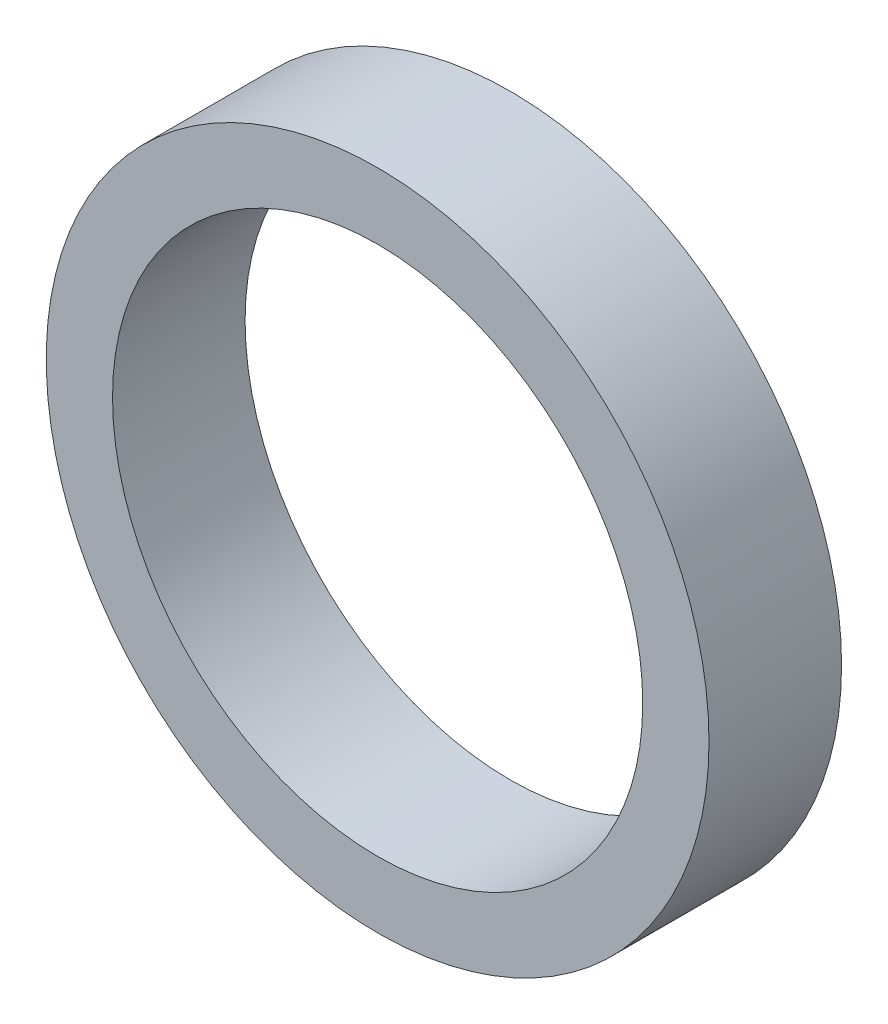
ISO-10303-21;
HEADER;
FILE_DESCRIPTION(('STEP AP214'),'2;1');
FILE_NAME('part.step','',(''),(''),'','','');
FILE_SCHEMA(('AUTOMOTIVE_DESIGN { 1 0 10303 214 1 1 1 1 }'));
ENDSEC;
DATA;
#1=APPLICATION_CONTEXT('core data for automotive mechanical design processes');
#2=APPLICATION_PROTOCOL_DEFINITION('international standard','automotive_design',2000,#1);
#3=PRODUCT_CONTEXT('',#1,'mechanical');
#4=PRODUCT('Part','Part','',(#3));
#5=PRODUCT_RELATED_PRODUCT_CATEGORY('part','',(#4));
#6=PRODUCT_DEFINITION_FORMATION('','',#4);
#7=PRODUCT_DEFINITION_CONTEXT('part definition',#1,'design');
#8=PRODUCT_DEFINITION('design','',#6,#7);
#9=PRODUCT_DEFINITION_SHAPE('','',#8);
#10=(LENGTH_UNIT() NAMED_UNIT(*) SI_UNIT(.MILLI.,.METRE.));
#11=(NAMED_UNIT(*) PLANE_ANGLE_UNIT() SI_UNIT($,.RADIAN.));
#12=(NAMED_UNIT(*) SI_UNIT($,.STERADIAN.) SOLID_ANGLE_UNIT());
#13=UNCERTAINTY_MEASURE_WITH_UNIT(LENGTH_MEASURE(1.E-05),#10,'distance_accuracy_value','');
#14=(GEOMETRIC_REPRESENTATION_CONTEXT(3) GLOBAL_UNCERTAINTY_ASSIGNED_CONTEXT((#13)) GLOBAL_UNIT_ASSIGNED_CONTEXT((#10,
#11,#12)) REPRESENTATION_CONTEXT('',''));
#15=CARTESIAN_POINT('',(0.,0.,0.));
#16=DIRECTION('',(0.,0.,1.));
#17=DIRECTION('',(1.,0.,0.));
#18=AXIS2_PLACEMENT_3D('',#15,#16,#17);
#19=CARTESIAN_POINT('',(0.,0.,2.));
#20=DIRECTION('',(0.,0.,1.));
#21=DIRECTION('',(1.,0.,0.));
#22=AXIS2_PLACEMENT_3D('',#19,#20,#21);
#23=PLANE('',#22);
#24=CARTESIAN_POINT('',(0.,0.,2.));
#25=DIRECTION('',(0.,0.,1.));
#26=DIRECTION('',(1.,0.,0.));
#27=AXIS2_PLACEMENT_3D('',#24,#25,#26);
#28=CIRCLE('',#27,5.);
#29=CARTESIAN_POINT('',(5.,0.,2.));
#30=VERTEX_POINT('',#29);
#31=EDGE_CURVE('E10',#30,#30,#28,.T.);
#32=ORIENTED_EDGE('',*,*,#31,.T.);
#33=EDGE_LOOP('',(#32));
#34=FACE_BOUND('',#33,.T.);
#35=CARTESIAN_POINT('',(0.,0.,2.));
#36=DIRECTION('',(0.,0.,1.));
#37=DIRECTION('',(1.,0.,0.));
#38=AXIS2_PLACEMENT_3D('',#35,#36,#37);
#39=CIRCLE('',#38,4.);
#40=CARTESIAN_POINT('',(4.,0.,2.));
#41=VERTEX_POINT('',#40);
#42=EDGE_CURVE('E46',#41,#41,#39,.T.);
#43=ORIENTED_EDGE('',*,*,#42,.F.);
#44=EDGE_LOOP('',(#43));
#45=FACE_BOUND('',#44,.T.);
#46=ADVANCED_FACE('F35',(#34,#45),#23,.T.);
#47=CARTESIAN_POINT('',(0.,0.,0.));
#48=DIRECTION('',(0.,0.,1.));
#49=DIRECTION('',(1.,0.,0.));
#50=AXIS2_PLACEMENT_3D('',#47,#48,#49);
#51=PLANE('',#50);
#52=CARTESIAN_POINT('',(0.,0.,0.));
#53=DIRECTION('',(0.,0.,1.));
#54=DIRECTION('',(1.,0.,0.));
#55=AXIS2_PLACEMENT_3D('',#52,#53,#54);
#56=CIRCLE('',#55,5.);
#57=CARTESIAN_POINT('',(5.,0.,0.));
#58=VERTEX_POINT('',#57);
#59=EDGE_CURVE('E39',#58,#58,#56,.T.);
#60=ORIENTED_EDGE('',*,*,#59,.F.);
#61=EDGE_LOOP('',(#60));
#62=FACE_BOUND('',#61,.T.);
#63=CARTESIAN_POINT('',(0.,0.,0.));
#64=DIRECTION('',(0.,0.,1.));
#65=DIRECTION('',(1.,0.,0.));
#66=AXIS2_PLACEMENT_3D('',#63,#64,#65);
#67=CIRCLE('',#66,4.);
#68=CARTESIAN_POINT('',(4.,0.,0.));
#69=VERTEX_POINT('',#68);
#70=EDGE_CURVE('E48',#69,#69,#67,.T.);
#71=ORIENTED_EDGE('',*,*,#70,.T.);
#72=EDGE_LOOP('',(#71));
#73=FACE_BOUND('',#72,.T.);
#74=ADVANCED_FACE('F58',(#62,#73),#51,.F.);
#75=CARTESIAN_POINT('',(0.,0.,2.));
#76=DIRECTION('',(0.,0.,-1.));
#77=DIRECTION('',(-1.,0.,0.));
#78=AXIS2_PLACEMENT_3D('',#75,#76,#77);
#79=CYLINDRICAL_SURFACE('',#78,5.);
#80=ORIENTED_EDGE('',*,*,#31,.F.);
#81=EDGE_LOOP('',(#80));
#82=FACE_BOUND('',#81,.T.);
#83=ORIENTED_EDGE('',*,*,#59,.T.);
#84=EDGE_LOOP('',(#83));
#85=FACE_BOUND('',#84,.T.);
#86=ADVANCED_FACE('F37',(#82,#85),#79,.T.);
#87=CARTESIAN_POINT('',(0.,0.,2.));
#88=DIRECTION('',(0.,0.,-1.));
#89=DIRECTION('',(-1.,0.,0.));
#90=AXIS2_PLACEMENT_3D('',#87,#88,#89);
#91=CYLINDRICAL_SURFACE('',#90,4.);
#92=ORIENTED_EDGE('',*,*,#42,.T.);
#93=EDGE_LOOP('',(#92));
#94=FACE_BOUND('',#93,.T.);
#95=ORIENTED_EDGE('',*,*,#70,.F.);
#96=EDGE_LOOP('',(#95));
#97=FACE_BOUND('',#96,.T.);
#98=ADVANCED_FACE('F54',(#94,#97),#91,.F.);
#99=CLOSED_SHELL('',(#46,#74,#86,#98));
#100=MANIFOLD_SOLID_BREP('B2',#99);
#101=ADVANCED_BREP_SHAPE_REPRESENTATION('',(#18,#100),#14);
#102=SHAPE_DEFINITION_REPRESENTATION(#9,#101);
ENDSEC;
END-ISO-10303-21;
